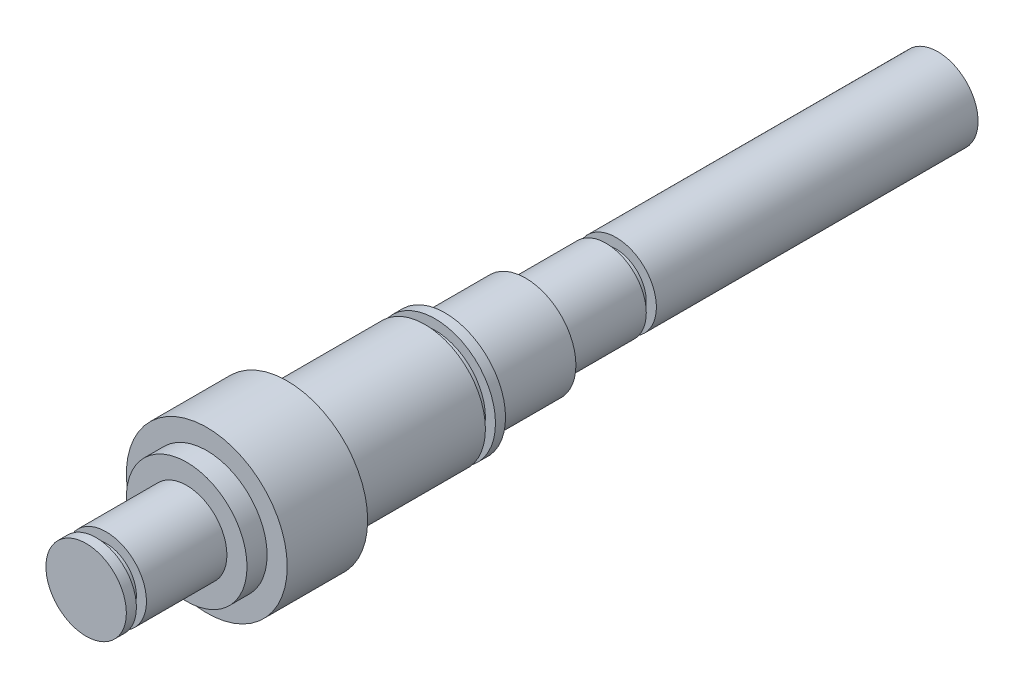
ISO-10303-21;
HEADER;
FILE_DESCRIPTION(('STEP AP214'),'2;1');
FILE_NAME('part.step','',(''),(''),'','','');
FILE_SCHEMA(('AUTOMOTIVE_DESIGN { 1 0 10303 214 1 1 1 1 }'));
ENDSEC;
DATA;
#1=APPLICATION_CONTEXT('core data for automotive mechanical design processes');
#2=APPLICATION_PROTOCOL_DEFINITION('international standard','automotive_design',2000,#1);
#3=PRODUCT_CONTEXT('',#1,'mechanical');
#4=PRODUCT('Part','Part','',(#3));
#5=PRODUCT_RELATED_PRODUCT_CATEGORY('part','',(#4));
#6=PRODUCT_DEFINITION_FORMATION('','',#4);
#7=PRODUCT_DEFINITION_CONTEXT('part definition',#1,'design');
#8=PRODUCT_DEFINITION('design','',#6,#7);
#9=PRODUCT_DEFINITION_SHAPE('','',#8);
#10=(LENGTH_UNIT() NAMED_UNIT(*) SI_UNIT(.MILLI.,.METRE.));
#11=(NAMED_UNIT(*) PLANE_ANGLE_UNIT() SI_UNIT($,.RADIAN.));
#12=(NAMED_UNIT(*) SI_UNIT($,.STERADIAN.) SOLID_ANGLE_UNIT());
#13=UNCERTAINTY_MEASURE_WITH_UNIT(LENGTH_MEASURE(1.E-05),#10,'distance_accuracy_value','');
#14=(GEOMETRIC_REPRESENTATION_CONTEXT(3) GLOBAL_UNCERTAINTY_ASSIGNED_CONTEXT((#13)) GLOBAL_UNIT_ASSIGNED_CONTEXT((#10,
#11,#12)) REPRESENTATION_CONTEXT('',''));
#15=CARTESIAN_POINT('',(0.,0.,0.));
#16=DIRECTION('',(0.,0.,1.));
#17=DIRECTION('',(1.,0.,0.));
#18=AXIS2_PLACEMENT_3D('',#15,#16,#17);
#19=CARTESIAN_POINT('',(0.,0.,25.4));
#20=DIRECTION('',(0.,0.,-1.));
#21=DIRECTION('',(-1.,0.,0.));
#22=AXIS2_PLACEMENT_3D('',#19,#20,#21);
#23=CYLINDRICAL_SURFACE('',#22,12.7);
#24=CARTESIAN_POINT('',(0.,0.,25.4));
#25=DIRECTION('',(0.,0.,1.));
#26=DIRECTION('',(1.,0.,0.));
#27=AXIS2_PLACEMENT_3D('',#24,#25,#26);
#28=CIRCLE('',#27,12.7);
#29=CARTESIAN_POINT('',(12.7,0.,25.4));
#30=VERTEX_POINT('',#29);
#31=EDGE_CURVE('E154',#30,#30,#28,.T.);
#32=ORIENTED_EDGE('',*,*,#31,.F.);
#33=EDGE_LOOP('',(#32));
#34=FACE_BOUND('',#33,.T.);
#35=CARTESIAN_POINT('',(0.,0.,0.));
#36=DIRECTION('',(0.,0.,1.));
#37=DIRECTION('',(1.,0.,0.));
#38=AXIS2_PLACEMENT_3D('',#35,#36,#37);
#39=CIRCLE('',#38,12.7);
#40=CARTESIAN_POINT('',(12.7,0.,0.));
#41=VERTEX_POINT('',#40);
#42=EDGE_CURVE('E164',#41,#41,#39,.T.);
#43=ORIENTED_EDGE('',*,*,#42,.T.);
#44=EDGE_LOOP('',(#43));
#45=FACE_BOUND('',#44,.T.);
#46=ADVANCED_FACE('F46',(#34,#45),#23,.T.);
#47=CARTESIAN_POINT('',(0.,0.,0.));
#48=DIRECTION('',(0.,0.,1.));
#49=DIRECTION('',(1.,0.,0.));
#50=AXIS2_PLACEMENT_3D('',#47,#48,#49);
#51=PLANE('',#50);
#52=CARTESIAN_POINT('',(0.,0.,0.));
#53=DIRECTION('',(0.,0.,-1.));
#54=DIRECTION('',(-1.,0.,0.));
#55=AXIS2_PLACEMENT_3D('',#52,#53,#54);
#56=CIRCLE('',#55,9.525);
#57=CARTESIAN_POINT('',(-9.525,0.,0.));
#58=VERTEX_POINT('',#57);
#59=EDGE_CURVE('E54',#58,#58,#56,.T.);
#60=ORIENTED_EDGE('',*,*,#59,.F.);
#61=EDGE_LOOP('',(#60));
#62=FACE_BOUND('',#61,.T.);
#63=ORIENTED_EDGE('',*,*,#42,.F.);
#64=EDGE_LOOP('',(#63));
#65=FACE_BOUND('',#64,.T.);
#66=ADVANCED_FACE('F237',(#62,#65),#51,.F.);
#67=CARTESIAN_POINT('',(0.,0.,50.8));
#68=DIRECTION('',(0.,0.,-1.));
#69=DIRECTION('',(-1.,0.,0.));
#70=AXIS2_PLACEMENT_3D('',#67,#68,#69);
#71=CYLINDRICAL_SURFACE('',#70,15.875);
#72=CARTESIAN_POINT('',(0.,0.,50.8));
#73=DIRECTION('',(0.,0.,1.));
#74=DIRECTION('',(1.,0.,0.));
#75=AXIS2_PLACEMENT_3D('',#72,#73,#74);
#76=CIRCLE('',#75,15.875);
#77=CARTESIAN_POINT('',(15.875,0.,50.8));
#78=VERTEX_POINT('',#77);
#79=EDGE_CURVE('E161',#78,#78,#76,.T.);
#80=ORIENTED_EDGE('',*,*,#79,.F.);
#81=EDGE_LOOP('',(#80));
#82=FACE_BOUND('',#81,.T.);
#83=CARTESIAN_POINT('',(0.,0.,25.4));
#84=DIRECTION('',(0.,0.,1.));
#85=DIRECTION('',(1.,0.,0.));
#86=AXIS2_PLACEMENT_3D('',#83,#84,#85);
#87=CIRCLE('',#86,15.875);
#88=CARTESIAN_POINT('',(15.875,0.,25.4));
#89=VERTEX_POINT('',#88);
#90=EDGE_CURVE('E158',#89,#89,#87,.T.);
#91=ORIENTED_EDGE('',*,*,#90,.T.);
#92=EDGE_LOOP('',(#91));
#93=FACE_BOUND('',#92,.T.);
#94=ADVANCED_FACE('F242',(#82,#93),#71,.T.);
#95=CARTESIAN_POINT('',(0.,0.,25.4));
#96=DIRECTION('',(0.,0.,1.));
#97=DIRECTION('',(1.,0.,0.));
#98=AXIS2_PLACEMENT_3D('',#95,#96,#97);
#99=PLANE('',#98);
#100=ORIENTED_EDGE('',*,*,#31,.T.);
#101=EDGE_LOOP('',(#100));
#102=FACE_BOUND('',#101,.T.);
#103=ORIENTED_EDGE('',*,*,#90,.F.);
#104=EDGE_LOOP('',(#103));
#105=FACE_BOUND('',#104,.T.);
#106=ADVANCED_FACE('F249',(#102,#105),#99,.F.);
#107=CARTESIAN_POINT('',(0.,0.,53.975));
#108=DIRECTION('',(0.,0.,-1.));
#109=DIRECTION('',(-1.,0.,0.));
#110=AXIS2_PLACEMENT_3D('',#107,#108,#109);
#111=CYLINDRICAL_SURFACE('',#110,19.05);
#112=CARTESIAN_POINT('',(0.,0.,53.975));
#113=DIRECTION('',(0.,0.,1.));
#114=DIRECTION('',(1.,0.,0.));
#115=AXIS2_PLACEMENT_3D('',#112,#113,#114);
#116=CIRCLE('',#115,19.05);
#117=CARTESIAN_POINT('',(19.05,0.,53.975));
#118=VERTEX_POINT('',#117);
#119=EDGE_CURVE('E155',#118,#118,#116,.T.);
#120=ORIENTED_EDGE('',*,*,#119,.F.);
#121=EDGE_LOOP('',(#120));
#122=FACE_BOUND('',#121,.T.);
#123=CARTESIAN_POINT('',(0.,0.,50.8));
#124=DIRECTION('',(0.,0.,1.));
#125=DIRECTION('',(1.,0.,0.));
#126=AXIS2_PLACEMENT_3D('',#123,#124,#125);
#127=CIRCLE('',#126,19.05);
#128=CARTESIAN_POINT('',(19.05,0.,50.8));
#129=VERTEX_POINT('',#128);
#130=EDGE_CURVE('E151',#129,#129,#127,.T.);
#131=ORIENTED_EDGE('',*,*,#130,.T.);
#132=EDGE_LOOP('',(#131));
#133=FACE_BOUND('',#132,.T.);
#134=ADVANCED_FACE('F252',(#122,#133),#111,.T.);
#135=CARTESIAN_POINT('',(0.,0.,53.975));
#136=DIRECTION('',(0.,0.,1.));
#137=DIRECTION('',(1.,0.,0.));
#138=AXIS2_PLACEMENT_3D('',#135,#136,#137);
#139=PLANE('',#138);
#140=CARTESIAN_POINT('',(0.,0.,53.975));
#141=DIRECTION('',(0.,0.,1.));
#142=DIRECTION('',(1.,0.,0.));
#143=AXIS2_PLACEMENT_3D('',#140,#141,#142);
#144=CIRCLE('',#143,15.875);
#145=CARTESIAN_POINT('',(15.875,0.,53.975));
#146=VERTEX_POINT('',#145);
#147=EDGE_CURVE('E136',#146,#146,#144,.T.);
#148=ORIENTED_EDGE('',*,*,#147,.F.);
#149=EDGE_LOOP('',(#148));
#150=FACE_BOUND('',#149,.T.);
#151=ORIENTED_EDGE('',*,*,#119,.T.);
#152=EDGE_LOOP('',(#151));
#153=FACE_BOUND('',#152,.T.);
#154=ADVANCED_FACE('F265',(#150,#153),#139,.T.);
#155=CARTESIAN_POINT('',(0.,0.,50.8));
#156=DIRECTION('',(0.,0.,1.));
#157=DIRECTION('',(1.,0.,0.));
#158=AXIS2_PLACEMENT_3D('',#155,#156,#157);
#159=PLANE('',#158);
#160=ORIENTED_EDGE('',*,*,#79,.T.);
#161=EDGE_LOOP('',(#160));
#162=FACE_BOUND('',#161,.T.);
#163=ORIENTED_EDGE('',*,*,#130,.F.);
#164=EDGE_LOOP('',(#163));
#165=FACE_BOUND('',#164,.T.);
#166=ADVANCED_FACE('F267',(#162,#165),#159,.F.);
#167=CARTESIAN_POINT('',(0.,0.,57.15));
#168=DIRECTION('',(0.,0.,-1.));
#169=DIRECTION('',(-1.,0.,0.));
#170=AXIS2_PLACEMENT_3D('',#167,#168,#169);
#171=CYLINDRICAL_SURFACE('',#170,15.875);
#172=CARTESIAN_POINT('',(0.,0.,57.15));
#173=DIRECTION('',(0.,0.,1.));
#174=DIRECTION('',(1.,0.,0.));
#175=AXIS2_PLACEMENT_3D('',#172,#173,#174);
#176=CIRCLE('',#175,15.875);
#177=CARTESIAN_POINT('',(15.875,0.,57.15));
#178=VERTEX_POINT('',#177);
#179=EDGE_CURVE('E146',#178,#178,#176,.T.);
#180=ORIENTED_EDGE('',*,*,#179,.F.);
#181=EDGE_LOOP('',(#180));
#182=FACE_BOUND('',#181,.T.);
#183=ORIENTED_EDGE('',*,*,#147,.T.);
#184=EDGE_LOOP('',(#183));
#185=FACE_BOUND('',#184,.T.);
#186=ADVANCED_FACE('F233',(#182,#185),#171,.T.);
#187=CARTESIAN_POINT('',(0.,0.,100.6856));
#188=DIRECTION('',(0.,0.,-1.));
#189=DIRECTION('',(-1.,0.,0.));
#190=AXIS2_PLACEMENT_3D('',#187,#188,#189);
#191=CYLINDRICAL_SURFACE('',#190,19.05);
#192=DIRECTION('',(0.,0.,-1.));
#193=VECTOR('',#192,1.);
#194=CARTESIAN_POINT('',(-3.175,-18.7835533113413,100.6856));
#195=LINE('',#194,#193);
#196=CARTESIAN_POINT('',(-3.175,-18.7835533113413,69.3928));
#197=VERTEX_POINT('',#196);
#198=CARTESIAN_POINT('',(-3.175,-18.7835533113413,88.4428));
#199=VERTEX_POINT('',#198);
#200=EDGE_CURVE('E49',#197,#199,#195,.F.);
#201=ORIENTED_EDGE('',*,*,#200,.T.);
#202=CARTESIAN_POINT('',(-3.17500000000001,-18.7835533113413,88.4428));
#203=CARTESIAN_POINT('',(-3.1750092759533,-18.783547018576,88.5314388053393));
#204=CARTESIAN_POINT('',(-3.17128819348967,-18.7841805998717,88.6200726993502));
#205=CARTESIAN_POINT('',(-3.15645721193542,-18.786680956619,88.7966940232313));
#206=CARTESIAN_POINT('',(-3.14534805241957,-18.7885476086355,88.8846815169173));
#207=CARTESIAN_POINT('',(-3.11583156311776,-18.79346444303,89.0592803464566));
#208=CARTESIAN_POINT('',(-3.0974335288372,-18.7965131178684,89.1458932895173));
#209=CARTESIAN_POINT('',(-3.05349803864484,-18.8037001907753,89.31721767784));
#210=CARTESIAN_POINT('',(-3.0279605898953,-18.8078385877505,89.4019291250095));
#211=CARTESIAN_POINT('',(-2.94087840596814,-18.8217226326604,89.6523560592743));
#212=CARTESIAN_POINT('',(-2.8688436825383,-18.8329407053693,89.8144825025615));
#213=CARTESIAN_POINT('',(-2.69899239592742,-18.8580290540045,90.1242636460318));
#214=CARTESIAN_POINT('',(-2.60117549729128,-18.8718993644387,90.2719181578843));
#215=CARTESIAN_POINT('',(-2.38149517786338,-18.9008817527466,90.5501135942982));
#216=CARTESIAN_POINT('',(-2.25942968994262,-18.9160035960679,90.6804942202037));
#217=CARTESIAN_POINT('',(-1.99514735350751,-18.9456996695127,90.9190292183636));
#218=CARTESIAN_POINT('',(-1.85292742138645,-18.9602738154065,91.0271801832893));
#219=CARTESIAN_POINT('',(-1.55132985812669,-18.9873352365175,91.2187867277449));
#220=CARTESIAN_POINT('',(-1.3918551557364,-18.9998095762792,91.3020915108715));
#221=CARTESIAN_POINT('',(-1.06094262734604,-19.0211554700442,91.4406650549574));
#222=CARTESIAN_POINT('',(-0.889506261733393,-19.0300274629556,91.4959372315998));
#223=CARTESIAN_POINT('',(-0.541204609731064,-19.0431004523526,91.5763880044264));
#224=CARTESIAN_POINT('',(-0.364403899939723,-19.0473437341617,91.6018391902149));
#225=CARTESIAN_POINT('',(-0.00898986065481108,-19.0508265250604,91.6227731224316));
#226=CARTESIAN_POINT('',(0.169623388276826,-19.0500662555787,91.6182571950335));
#227=CARTESIAN_POINT('',(0.521719337398837,-19.0436608919272,91.5795966229835));
#228=CARTESIAN_POINT('',(0.695235345117891,-19.0380642966246,91.5457461369747));
#229=CARTESIAN_POINT('',(1.03408837128149,-19.0226692681399,91.4498407274997));
#230=CARTESIAN_POINT('',(1.19942519266638,-19.0128707337761,91.3877851248594));
#231=CARTESIAN_POINT('',(1.51810527783592,-18.9900900579044,91.23693752744));
#232=CARTESIAN_POINT('',(1.67138986912094,-18.9770934783148,91.1480238513692));
#233=CARTESIAN_POINT('',(1.96096832556615,-18.9493613252356,90.9460763114251));
#234=CARTESIAN_POINT('',(2.09726144683351,-18.9346256756637,90.8330413921021));
#235=CARTESIAN_POINT('',(2.35071590026175,-18.9048444663073,90.5844458544069));
#236=CARTESIAN_POINT('',(2.46762776771632,-18.8897973100375,90.4486309773923));
#237=CARTESIAN_POINT('',(2.67707682879147,-18.8612558492788,90.1591343348761));
#238=CARTESIAN_POINT('',(2.76960707287949,-18.8477619881439,90.0054474932527));
#239=CARTESIAN_POINT('',(2.92771595769529,-18.8238521316789,89.6842585044252));
#240=CARTESIAN_POINT('',(2.99324880029341,-18.8134413748372,89.5167334553005));
#241=CARTESIAN_POINT('',(3.09508123713193,-18.7969592772761,89.1729556798652));
#242=CARTESIAN_POINT('',(3.1314245377521,-18.7908814502698,88.9967164232592));
#243=CARTESIAN_POINT('',(3.16010272278867,-18.786066088157,88.7564140581634));
#244=CARTESIAN_POINT('',(3.16569153246618,-18.7851246388065,88.6937698049232));
#245=CARTESIAN_POINT('',(3.17313530936847,-18.7838688841059,88.5683595013504));
#246=CARTESIAN_POINT('',(3.17499655594535,-18.7835535240705,88.5055938344384));
#247=CARTESIAN_POINT('',(3.175,-18.7835533113413,88.4428));
#248=B_SPLINE_CURVE_WITH_KNOTS('',3,(#202,#203,#204,#205,#206,#207,#208,#209,#210,#211,#212,
#213,#214,#215,#216,#217,#218,#219,#220,#221,#222,#223,#224,#225,#226,#227,#228,#229,#230,#231,
#232,#233,#234,#235,#236,#237,#238,#239,#240,#241,#242,#243,#244,#245,#246,#247),.UNSPECIFIED.,
.F.,.F.,(4,2,2,2,2,2,2,2,2,2,2,2,2,2,2,2,2,2,2,2,2,2,4),(0.,0.265827424316422,0.531628242295368,
0.797091169938624,1.06255383127045,1.59312333078712,2.12369973395087,2.65889847189159,
3.19417918320543,3.73264543374023,4.27104605811873,4.80448586210931,5.33790205925133,
5.86603040471272,6.3941714680841,6.92474212132518,7.45533599499394,7.99230308222494,
8.52942305687614,9.06745048147124,9.60467079162542,9.79328570472903,9.98158261408197),.UNSPECIFIED.);
#249=CARTESIAN_POINT('',(3.175,-18.7835533113413,88.4428));
#250=VERTEX_POINT('',#249);
#251=EDGE_CURVE('E129',#199,#250,#248,.T.);
#252=ORIENTED_EDGE('',*,*,#251,.T.);
#253=DIRECTION('',(0.,0.,-1.));
#254=VECTOR('',#253,1.);
#255=CARTESIAN_POINT('',(3.17500000000001,-18.7835533113413,100.6856));
#256=LINE('',#255,#254);
#257=CARTESIAN_POINT('',(3.17500000000001,-18.7835533113413,69.3928));
#258=VERTEX_POINT('',#257);
#259=EDGE_CURVE('E504',#250,#258,#256,.T.);
#260=ORIENTED_EDGE('',*,*,#259,.T.);
#261=CARTESIAN_POINT('',(3.175,-18.7835533113413,69.3928));
#262=CARTESIAN_POINT('',(3.1750092759533,-18.783547018576,69.3041611946607));
#263=CARTESIAN_POINT('',(3.17128819348967,-18.7841805998717,69.2155273006497));
#264=CARTESIAN_POINT('',(3.15645721193542,-18.786680956619,69.0389059767687));
#265=CARTESIAN_POINT('',(3.14534805241957,-18.7885476086355,68.9509184830827));
#266=CARTESIAN_POINT('',(3.11583156311776,-18.79346444303,68.7763196535433));
#267=CARTESIAN_POINT('',(3.0974335288372,-18.7965131178684,68.6897067104826));
#268=CARTESIAN_POINT('',(3.05349803864483,-18.8037001907753,68.5183823221599));
#269=CARTESIAN_POINT('',(3.02796058989529,-18.8078385877505,68.4336708749905));
#270=CARTESIAN_POINT('',(2.94087840596814,-18.8217226326604,68.1832439407257));
#271=CARTESIAN_POINT('',(2.8688436825383,-18.8329407053693,68.0211174974384));
#272=CARTESIAN_POINT('',(2.69899239592742,-18.8580290540045,67.7113363539682));
#273=CARTESIAN_POINT('',(2.60117549729128,-18.8718993644387,67.5636818421157));
#274=CARTESIAN_POINT('',(2.38149517786337,-18.9008817527466,67.2854864057018));
#275=CARTESIAN_POINT('',(2.25942968994262,-18.9160035960679,67.1551057797962));
#276=CARTESIAN_POINT('',(1.99514735350751,-18.9456996695127,66.9165707816364));
#277=CARTESIAN_POINT('',(1.85292742138645,-18.9602738154065,66.8084198167107));
#278=CARTESIAN_POINT('',(1.55132985812669,-18.9873352365175,66.616813272255));
#279=CARTESIAN_POINT('',(1.3918551557364,-18.9998095762792,66.5335084891284));
#280=CARTESIAN_POINT('',(1.06094262734604,-19.0211554700442,66.3949349450426));
#281=CARTESIAN_POINT('',(0.889506261733391,-19.0300274629556,66.3396627684001));
#282=CARTESIAN_POINT('',(0.541204609731062,-19.0431004523526,66.2592119955735));
#283=CARTESIAN_POINT('',(0.364403899939721,-19.0473437341617,66.233760809785));
#284=CARTESIAN_POINT('',(0.00898986065480973,-19.0508265250604,66.2128268775683));
#285=CARTESIAN_POINT('',(-0.169623388276827,-19.0500662555787,66.2173428049665));
#286=CARTESIAN_POINT('',(-0.521719337398839,-19.0436608919272,66.2560033770164));
#287=CARTESIAN_POINT('',(-0.695235345117893,-19.0380642966246,66.2898538630253));
#288=CARTESIAN_POINT('',(-1.0340883712815,-19.0226692681399,66.3857592725003));
#289=CARTESIAN_POINT('',(-1.19942519266639,-19.0128707337761,66.4478148751405));
#290=CARTESIAN_POINT('',(-1.51810527783592,-18.9900900579044,66.59866247256));
#291=CARTESIAN_POINT('',(-1.67138986912094,-18.9770934783148,66.6875761486308));
#292=CARTESIAN_POINT('',(-1.96096832556615,-18.9493613252356,66.8895236885748));
#293=CARTESIAN_POINT('',(-2.09726144683351,-18.9346256756637,67.0025586078979));
#294=CARTESIAN_POINT('',(-2.35071590026175,-18.9048444663073,67.2511541455931));
#295=CARTESIAN_POINT('',(-2.46762776771632,-18.8897973100375,67.3869690226077));
#296=CARTESIAN_POINT('',(-2.67707682879147,-18.8612558492788,67.6764656651238));
#297=CARTESIAN_POINT('',(-2.76960707287949,-18.8477619881439,67.8301525067473));
#298=CARTESIAN_POINT('',(-2.92771595769529,-18.8238521316789,68.1513414955748));
#299=CARTESIAN_POINT('',(-2.99324880029341,-18.8134413748372,68.3188665446994));
#300=CARTESIAN_POINT('',(-3.09508123713194,-18.7969592772761,68.6626443201348));
#301=CARTESIAN_POINT('',(-3.1314245377521,-18.7908814502698,68.8388835767408));
#302=CARTESIAN_POINT('',(-3.16010272278867,-18.786066088157,69.0791859418366));
#303=CARTESIAN_POINT('',(-3.16569153246618,-18.7851246388065,69.1418301950768));
#304=CARTESIAN_POINT('',(-3.17313530936847,-18.7838688841059,69.2672404986495));
#305=CARTESIAN_POINT('',(-3.17499655594535,-18.7835535240705,69.3300061655616));
#306=CARTESIAN_POINT('',(-3.17500000000001,-18.7835533113413,69.3928));
#307=B_SPLINE_CURVE_WITH_KNOTS('',3,(#261,#262,#263,#264,#265,#266,#267,#268,#269,#270,#271,
#272,#273,#274,#275,#276,#277,#278,#279,#280,#281,#282,#283,#284,#285,#286,#287,#288,#289,#290,
#291,#292,#293,#294,#295,#296,#297,#298,#299,#300,#301,#302,#303,#304,#305,#306),.UNSPECIFIED.,
.F.,.F.,(4,2,2,2,2,2,2,2,2,2,2,2,2,2,2,2,2,2,2,2,2,2,4),(0.,0.265827424316422,0.531628242295368,
0.797091169938638,1.06255383127045,1.59312333078712,2.12369973395087,2.65889847189159,
3.19417918320543,3.73264543374023,4.27104605811873,4.80448586210931,5.33790205925133,
5.86603040471272,6.3941714680841,6.92474212132518,7.45533599499394,7.99230308222494,
8.52942305687614,9.06745048147124,9.60467079162542,9.79328570472902,9.98158261408196),.UNSPECIFIED.);
#308=EDGE_CURVE('E62',#258,#197,#307,.T.);
#309=ORIENTED_EDGE('',*,*,#308,.T.);
#310=EDGE_LOOP('',(#201,#252,#260,#309));
#311=FACE_BOUND('',#310,.T.);
#312=CARTESIAN_POINT('',(0.,0.,100.6856));
#313=DIRECTION('',(0.,0.,1.));
#314=DIRECTION('',(1.,0.,0.));
#315=AXIS2_PLACEMENT_3D('',#312,#313,#314);
#316=CIRCLE('',#315,19.05);
#317=CARTESIAN_POINT('',(19.05,0.,100.6856));
#318=VERTEX_POINT('',#317);
#319=EDGE_CURVE('E143',#318,#318,#316,.T.);
#320=ORIENTED_EDGE('',*,*,#319,.F.);
#321=EDGE_LOOP('',(#320));
#322=FACE_BOUND('',#321,.T.);
#323=CARTESIAN_POINT('',(0.,0.,57.15));
#324=DIRECTION('',(0.,0.,1.));
#325=DIRECTION('',(1.,0.,0.));
#326=AXIS2_PLACEMENT_3D('',#323,#324,#325);
#327=CIRCLE('',#326,19.05);
#328=CARTESIAN_POINT('',(19.05,0.,57.15));
#329=VERTEX_POINT('',#328);
#330=EDGE_CURVE('E140',#329,#329,#327,.T.);
#331=ORIENTED_EDGE('',*,*,#330,.T.);
#332=EDGE_LOOP('',(#331));
#333=FACE_BOUND('',#332,.T.);
#334=ADVANCED_FACE('F184',(#311,#322,#333),#191,.T.);
#335=CARTESIAN_POINT('',(0.,0.,57.15));
#336=DIRECTION('',(0.,0.,1.));
#337=DIRECTION('',(1.,0.,0.));
#338=AXIS2_PLACEMENT_3D('',#335,#336,#337);
#339=PLANE('',#338);
#340=ORIENTED_EDGE('',*,*,#179,.T.);
#341=EDGE_LOOP('',(#340));
#342=FACE_BOUND('',#341,.T.);
#343=ORIENTED_EDGE('',*,*,#330,.F.);
#344=EDGE_LOOP('',(#343));
#345=FACE_BOUND('',#344,.T.);
#346=ADVANCED_FACE('F226',(#342,#345),#339,.F.);
#347=CARTESIAN_POINT('',(0.,0.,126.0856));
#348=DIRECTION('',(0.,0.,-1.));
#349=DIRECTION('',(-1.,0.,0.));
#350=AXIS2_PLACEMENT_3D('',#347,#348,#349);
#351=CYLINDRICAL_SURFACE('',#350,25.4);
#352=CARTESIAN_POINT('',(0.,0.,126.0856));
#353=DIRECTION('',(0.,0.,1.));
#354=DIRECTION('',(1.,0.,0.));
#355=AXIS2_PLACEMENT_3D('',#352,#353,#354);
#356=CIRCLE('',#355,25.4);
#357=CARTESIAN_POINT('',(25.4,0.,126.0856));
#358=VERTEX_POINT('',#357);
#359=EDGE_CURVE('E137',#358,#358,#356,.T.);
#360=ORIENTED_EDGE('',*,*,#359,.F.);
#361=EDGE_LOOP('',(#360));
#362=FACE_BOUND('',#361,.T.);
#363=CARTESIAN_POINT('',(0.,0.,100.6856));
#364=DIRECTION('',(0.,0.,1.));
#365=DIRECTION('',(1.,0.,0.));
#366=AXIS2_PLACEMENT_3D('',#363,#364,#365);
#367=CIRCLE('',#366,25.4);
#368=CARTESIAN_POINT('',(25.4,0.,100.6856));
#369=VERTEX_POINT('',#368);
#370=EDGE_CURVE('E133',#369,#369,#367,.T.);
#371=ORIENTED_EDGE('',*,*,#370,.T.);
#372=EDGE_LOOP('',(#371));
#373=FACE_BOUND('',#372,.T.);
#374=ADVANCED_FACE('F220',(#362,#373),#351,.T.);
#375=CARTESIAN_POINT('',(0.,0.,126.0856));
#376=DIRECTION('',(0.,0.,1.));
#377=DIRECTION('',(1.,0.,0.));
#378=AXIS2_PLACEMENT_3D('',#375,#376,#377);
#379=PLANE('',#378);
#380=CARTESIAN_POINT('',(0.,0.,126.0856));
#381=DIRECTION('',(0.,0.,1.));
#382=DIRECTION('',(1.,0.,0.));
#383=AXIS2_PLACEMENT_3D('',#380,#381,#382);
#384=CIRCLE('',#383,19.05);
#385=CARTESIAN_POINT('',(19.05,0.,126.0856));
#386=VERTEX_POINT('',#385);
#387=EDGE_CURVE('E130',#386,#386,#384,.T.);
#388=ORIENTED_EDGE('',*,*,#387,.F.);
#389=EDGE_LOOP('',(#388));
#390=FACE_BOUND('',#389,.T.);
#391=ORIENTED_EDGE('',*,*,#359,.T.);
#392=EDGE_LOOP('',(#391));
#393=FACE_BOUND('',#392,.T.);
#394=ADVANCED_FACE('F217',(#390,#393),#379,.T.);
#395=CARTESIAN_POINT('',(0.,0.,100.6856));
#396=DIRECTION('',(0.,0.,1.));
#397=DIRECTION('',(1.,0.,0.));
#398=AXIS2_PLACEMENT_3D('',#395,#396,#397);
#399=PLANE('',#398);
#400=ORIENTED_EDGE('',*,*,#319,.T.);
#401=EDGE_LOOP('',(#400));
#402=FACE_BOUND('',#401,.T.);
#403=ORIENTED_EDGE('',*,*,#370,.F.);
#404=EDGE_LOOP('',(#403));
#405=FACE_BOUND('',#404,.T.);
#406=ADVANCED_FACE('F215',(#402,#405),#399,.F.);
#407=CARTESIAN_POINT('',(0.,0.,132.4356));
#408=DIRECTION('',(0.,0.,-1.));
#409=DIRECTION('',(-1.,0.,0.));
#410=AXIS2_PLACEMENT_3D('',#407,#408,#409);
#411=CYLINDRICAL_SURFACE('',#410,19.05);
#412=CARTESIAN_POINT('',(0.,0.,132.4356));
#413=DIRECTION('',(0.,0.,1.));
#414=DIRECTION('',(1.,0.,0.));
#415=AXIS2_PLACEMENT_3D('',#412,#413,#414);
#416=CIRCLE('',#415,19.05);
#417=CARTESIAN_POINT('',(19.05,0.,132.4356));
#418=VERTEX_POINT('',#417);
#419=EDGE_CURVE('E125',#418,#418,#416,.T.);
#420=ORIENTED_EDGE('',*,*,#419,.F.);
#421=EDGE_LOOP('',(#420));
#422=FACE_BOUND('',#421,.T.);
#423=ORIENTED_EDGE('',*,*,#387,.T.);
#424=EDGE_LOOP('',(#423));
#425=FACE_BOUND('',#424,.T.);
#426=ADVANCED_FACE('F211',(#422,#425),#411,.T.);
#427=CARTESIAN_POINT('',(0.,0.,132.4356));
#428=DIRECTION('',(0.,0.,1.));
#429=DIRECTION('',(1.,0.,0.));
#430=AXIS2_PLACEMENT_3D('',#427,#428,#429);
#431=PLANE('',#430);
#432=CARTESIAN_POINT('',(0.,0.,132.4356));
#433=DIRECTION('',(0.,0.,1.));
#434=DIRECTION('',(1.,0.,0.));
#435=AXIS2_PLACEMENT_3D('',#432,#433,#434);
#436=CIRCLE('',#435,12.7);
#437=CARTESIAN_POINT('',(12.7,0.,132.4356));
#438=VERTEX_POINT('',#437);
#439=EDGE_CURVE('E126',#438,#438,#436,.T.);
#440=ORIENTED_EDGE('',*,*,#439,.F.);
#441=EDGE_LOOP('',(#440));
#442=FACE_BOUND('',#441,.T.);
#443=ORIENTED_EDGE('',*,*,#419,.T.);
#444=EDGE_LOOP('',(#443));
#445=FACE_BOUND('',#444,.T.);
#446=ADVANCED_FACE('F207',(#442,#445),#431,.T.);
#447=CARTESIAN_POINT('',(0.,0.,157.8356));
#448=DIRECTION('',(0.,0.,-1.));
#449=DIRECTION('',(-1.,0.,0.));
#450=AXIS2_PLACEMENT_3D('',#447,#448,#449);
#451=CYLINDRICAL_SURFACE('',#450,12.7);
#452=CARTESIAN_POINT('',(0.,0.,157.8356));
#453=DIRECTION('',(0.,0.,1.));
#454=DIRECTION('',(1.,0.,0.));
#455=AXIS2_PLACEMENT_3D('',#452,#453,#454);
#456=CIRCLE('',#455,12.7);
#457=CARTESIAN_POINT('',(12.7,0.,157.8356));
#458=VERTEX_POINT('',#457);
#459=EDGE_CURVE('E119',#458,#458,#456,.T.);
#460=ORIENTED_EDGE('',*,*,#459,.F.);
#461=EDGE_LOOP('',(#460));
#462=FACE_BOUND('',#461,.T.);
#463=ORIENTED_EDGE('',*,*,#439,.T.);
#464=EDGE_LOOP('',(#463));
#465=FACE_BOUND('',#464,.T.);
#466=ADVANCED_FACE('F203',(#462,#465),#451,.T.);
#467=CARTESIAN_POINT('',(0.,0.,157.8356));
#468=DIRECTION('',(0.,0.,1.));
#469=DIRECTION('',(1.,0.,0.));
#470=AXIS2_PLACEMENT_3D('',#467,#468,#469);
#471=PLANE('',#470);
#472=CARTESIAN_POINT('',(0.,0.,157.8356));
#473=DIRECTION('',(0.,0.,1.));
#474=DIRECTION('',(1.,0.,0.));
#475=AXIS2_PLACEMENT_3D('',#472,#473,#474);
#476=CIRCLE('',#475,9.525);
#477=CARTESIAN_POINT('',(9.525,0.,157.8356));
#478=VERTEX_POINT('',#477);
#479=EDGE_CURVE('E13',#478,#478,#476,.T.);
#480=ORIENTED_EDGE('',*,*,#479,.F.);
#481=EDGE_LOOP('',(#480));
#482=FACE_BOUND('',#481,.T.);
#483=ORIENTED_EDGE('',*,*,#459,.T.);
#484=EDGE_LOOP('',(#483));
#485=FACE_BOUND('',#484,.T.);
#486=ADVANCED_FACE('F200',(#482,#485),#471,.T.);
#487=CARTESIAN_POINT('',(0.,-15.875,69.3928));
#488=DIRECTION('',(0.,-1.,0.));
#489=DIRECTION('',(0.,0.,-1.));
#490=AXIS2_PLACEMENT_3D('',#487,#488,#489);
#491=CYLINDRICAL_SURFACE('',#490,3.175);
#492=DIRECTION('',(0.,-1.,0.));
#493=VECTOR('',#492,1.);
#494=CARTESIAN_POINT('',(3.17500000000001,-15.875,69.3928));
#495=LINE('',#494,#493);
#496=CARTESIAN_POINT('',(3.17500000000001,-15.875,69.3928));
#497=VERTEX_POINT('',#496);
#498=EDGE_CURVE('E86',#497,#258,#495,.T.);
#499=ORIENTED_EDGE('',*,*,#498,.F.);
#500=CARTESIAN_POINT('',(0.,-15.875,69.3928));
#501=DIRECTION('',(0.,-1.,0.));
#502=DIRECTION('',(0.,0.,-1.));
#503=AXIS2_PLACEMENT_3D('',#500,#501,#502);
#504=CIRCLE('',#503,3.175);
#505=CARTESIAN_POINT('',(-3.175,-15.875,69.3928));
#506=VERTEX_POINT('',#505);
#507=EDGE_CURVE('E90',#506,#497,#504,.T.);
#508=ORIENTED_EDGE('',*,*,#507,.F.);
#509=DIRECTION('',(0.,-1.,0.));
#510=VECTOR('',#509,1.);
#511=CARTESIAN_POINT('',(-3.175,-15.875,69.3928));
#512=LINE('',#511,#510);
#513=EDGE_CURVE('E117',#506,#197,#512,.T.);
#514=ORIENTED_EDGE('',*,*,#513,.T.);
#515=ORIENTED_EDGE('',*,*,#308,.F.);
#516=EDGE_LOOP('',(#499,#508,#514,#515));
#517=FACE_BOUND('',#516,.T.);
#518=ADVANCED_FACE('F88',(#517),#491,.F.);
#519=CARTESIAN_POINT('',(-3.175,-15.875,69.3928));
#520=DIRECTION('',(-1.,0.,0.));
#521=DIRECTION('',(0.,0.,1.));
#522=AXIS2_PLACEMENT_3D('',#519,#520,#521);
#523=PLANE('',#522);
#524=ORIENTED_EDGE('',*,*,#513,.F.);
#525=DIRECTION('',(0.,0.,-1.));
#526=VECTOR('',#525,1.);
#527=CARTESIAN_POINT('',(-3.175,-15.875,69.3928));
#528=LINE('',#527,#526);
#529=CARTESIAN_POINT('',(-3.175,-15.875,88.4428));
#530=VERTEX_POINT('',#529);
#531=EDGE_CURVE('E95',#530,#506,#528,.T.);
#532=ORIENTED_EDGE('',*,*,#531,.F.);
#533=DIRECTION('',(0.,-1.,0.));
#534=VECTOR('',#533,1.);
#535=CARTESIAN_POINT('',(-3.175,-15.875,88.4428));
#536=LINE('',#535,#534);
#537=EDGE_CURVE('E120',#530,#199,#536,.T.);
#538=ORIENTED_EDGE('',*,*,#537,.T.);
#539=ORIENTED_EDGE('',*,*,#200,.F.);
#540=EDGE_LOOP('',(#524,#532,#538,#539));
#541=FACE_BOUND('',#540,.T.);
#542=ADVANCED_FACE('F193',(#541),#523,.F.);
#543=CARTESIAN_POINT('',(0.,-15.875,88.4428));
#544=DIRECTION('',(0.,-1.,0.));
#545=DIRECTION('',(0.,0.,-1.));
#546=AXIS2_PLACEMENT_3D('',#543,#544,#545);
#547=CYLINDRICAL_SURFACE('',#546,3.175);
#548=ORIENTED_EDGE('',*,*,#537,.F.);
#549=CARTESIAN_POINT('',(0.,-15.875,88.4428));
#550=DIRECTION('',(0.,-1.,0.));
#551=DIRECTION('',(0.,0.,-1.));
#552=AXIS2_PLACEMENT_3D('',#549,#550,#551);
#553=CIRCLE('',#552,3.175);
#554=CARTESIAN_POINT('',(3.175,-15.875,88.4428));
#555=VERTEX_POINT('',#554);
#556=EDGE_CURVE('E104',#555,#530,#553,.T.);
#557=ORIENTED_EDGE('',*,*,#556,.F.);
#558=DIRECTION('',(0.,-1.,0.));
#559=VECTOR('',#558,1.);
#560=CARTESIAN_POINT('',(3.175,-15.875,88.4428));
#561=LINE('',#560,#559);
#562=EDGE_CURVE('E94',#555,#250,#561,.T.);
#563=ORIENTED_EDGE('',*,*,#562,.T.);
#564=ORIENTED_EDGE('',*,*,#251,.F.);
#565=EDGE_LOOP('',(#548,#557,#563,#564));
#566=FACE_BOUND('',#565,.T.);
#567=ADVANCED_FACE('F188',(#566),#547,.F.);
#568=CARTESIAN_POINT('',(3.17500000000001,-15.875,69.3928));
#569=DIRECTION('',(1.,0.,0.));
#570=DIRECTION('',(0.,0.,-1.));
#571=AXIS2_PLACEMENT_3D('',#568,#569,#570);
#572=PLANE('',#571);
#573=ORIENTED_EDGE('',*,*,#562,.F.);
#574=DIRECTION('',(0.,0.,1.));
#575=VECTOR('',#574,1.);
#576=CARTESIAN_POINT('',(3.17500000000001,-15.875,69.3928));
#577=LINE('',#576,#575);
#578=EDGE_CURVE('E98',#497,#555,#577,.T.);
#579=ORIENTED_EDGE('',*,*,#578,.F.);
#580=ORIENTED_EDGE('',*,*,#498,.T.);
#581=ORIENTED_EDGE('',*,*,#259,.F.);
#582=EDGE_LOOP('',(#573,#579,#580,#581));
#583=FACE_BOUND('',#582,.T.);
#584=ADVANCED_FACE('F99',(#583),#572,.F.);
#585=CARTESIAN_POINT('',(0.,-15.875,69.3928));
#586=DIRECTION('',(0.,-1.,0.));
#587=DIRECTION('',(0.,0.,-1.));
#588=AXIS2_PLACEMENT_3D('',#585,#586,#587);
#589=PLANE('',#588);
#590=ORIENTED_EDGE('',*,*,#507,.T.);
#591=ORIENTED_EDGE('',*,*,#578,.T.);
#592=ORIENTED_EDGE('',*,*,#556,.T.);
#593=ORIENTED_EDGE('',*,*,#531,.T.);
#594=EDGE_LOOP('',(#590,#591,#592,#593));
#595=FACE_BOUND('',#594,.T.);
#596=ADVANCED_FACE('F106',(#595),#589,.T.);
#597=CARTESIAN_POINT('',(0.,0.,-3.175));
#598=DIRECTION('',(0.,0.,1.));
#599=DIRECTION('',(1.,0.,0.));
#600=AXIS2_PLACEMENT_3D('',#597,#598,#599);
#601=CYLINDRICAL_SURFACE('',#600,9.525);
#602=CARTESIAN_POINT('',(0.,0.,-3.175));
#603=DIRECTION('',(0.,0.,-1.));
#604=DIRECTION('',(-1.,0.,0.));
#605=AXIS2_PLACEMENT_3D('',#602,#603,#604);
#606=CIRCLE('',#605,9.525);
#607=CARTESIAN_POINT('',(-9.525,0.,-3.175));
#608=VERTEX_POINT('',#607);
#609=EDGE_CURVE('E108',#608,#608,#606,.T.);
#610=ORIENTED_EDGE('',*,*,#609,.F.);
#611=EDGE_LOOP('',(#610));
#612=FACE_BOUND('',#611,.T.);
#613=ORIENTED_EDGE('',*,*,#59,.T.);
#614=EDGE_LOOP('',(#613));
#615=FACE_BOUND('',#614,.T.);
#616=ADVANCED_FACE('F332',(#612,#615),#601,.T.);
#617=CARTESIAN_POINT('',(0.,0.,-104.775));
#618=DIRECTION('',(0.,0.,1.));
#619=DIRECTION('',(1.,0.,0.));
#620=AXIS2_PLACEMENT_3D('',#617,#618,#619);
#621=CYLINDRICAL_SURFACE('',#620,12.7);
#622=CARTESIAN_POINT('',(0.,0.,-104.775));
#623=DIRECTION('',(0.,0.,-1.));
#624=DIRECTION('',(-1.,0.,0.));
#625=AXIS2_PLACEMENT_3D('',#622,#623,#624);
#626=CIRCLE('',#625,12.7);
#627=CARTESIAN_POINT('',(-12.7,0.,-104.775));
#628=VERTEX_POINT('',#627);
#629=EDGE_CURVE('E111',#628,#628,#626,.T.);
#630=ORIENTED_EDGE('',*,*,#629,.F.);
#631=EDGE_LOOP('',(#630));
#632=FACE_BOUND('',#631,.T.);
#633=CARTESIAN_POINT('',(0.,0.,-3.175));
#634=DIRECTION('',(0.,0.,-1.));
#635=DIRECTION('',(-1.,0.,0.));
#636=AXIS2_PLACEMENT_3D('',#633,#634,#635);
#637=CIRCLE('',#636,12.7);
#638=CARTESIAN_POINT('',(-12.7,0.,-3.175));
#639=VERTEX_POINT('',#638);
#640=EDGE_CURVE('E440',#639,#639,#637,.T.);
#641=ORIENTED_EDGE('',*,*,#640,.T.);
#642=EDGE_LOOP('',(#641));
#643=FACE_BOUND('',#642,.T.);
#644=ADVANCED_FACE('F348',(#632,#643),#621,.T.);
#645=CARTESIAN_POINT('',(0.,0.,-104.775));
#646=DIRECTION('',(0.,0.,-1.));
#647=DIRECTION('',(-1.,0.,0.));
#648=AXIS2_PLACEMENT_3D('',#645,#646,#647);
#649=PLANE('',#648);
#650=ORIENTED_EDGE('',*,*,#629,.T.);
#651=EDGE_LOOP('',(#650));
#652=FACE_BOUND('',#651,.T.);
#653=ADVANCED_FACE('F358',(#652),#649,.T.);
#654=CARTESIAN_POINT('',(0.,0.,-3.175));
#655=DIRECTION('',(0.,0.,-1.));
#656=DIRECTION('',(-1.,0.,0.));
#657=AXIS2_PLACEMENT_3D('',#654,#655,#656);
#658=PLANE('',#657);
#659=ORIENTED_EDGE('',*,*,#609,.T.);
#660=EDGE_LOOP('',(#659));
#661=FACE_BOUND('',#660,.T.);
#662=ORIENTED_EDGE('',*,*,#640,.F.);
#663=EDGE_LOOP('',(#662));
#664=FACE_BOUND('',#663,.T.);
#665=ADVANCED_FACE('F368',(#661,#664),#658,.F.);
#666=CARTESIAN_POINT('',(0.,0.,161.0106));
#667=DIRECTION('',(0.,0.,-1.));
#668=DIRECTION('',(-1.,0.,0.));
#669=AXIS2_PLACEMENT_3D('',#666,#667,#668);
#670=CYLINDRICAL_SURFACE('',#669,9.525);
#671=CARTESIAN_POINT('',(0.,0.,161.0106));
#672=DIRECTION('',(0.,0.,1.));
#673=DIRECTION('',(1.,0.,0.));
#674=AXIS2_PLACEMENT_3D('',#671,#672,#673);
#675=CIRCLE('',#674,9.525);
#676=CARTESIAN_POINT('',(9.525,0.,161.0106));
#677=VERTEX_POINT('',#676);
#678=EDGE_CURVE('E430',#677,#677,#675,.T.);
#679=ORIENTED_EDGE('',*,*,#678,.F.);
#680=EDGE_LOOP('',(#679));
#681=FACE_BOUND('',#680,.T.);
#682=ORIENTED_EDGE('',*,*,#479,.T.);
#683=EDGE_LOOP('',(#682));
#684=FACE_BOUND('',#683,.T.);
#685=ADVANCED_FACE('F378',(#681,#684),#670,.T.);
#686=CARTESIAN_POINT('',(0.,0.,164.1856));
#687=DIRECTION('',(0.,0.,-1.));
#688=DIRECTION('',(-1.,0.,0.));
#689=AXIS2_PLACEMENT_3D('',#686,#687,#688);
#690=CYLINDRICAL_SURFACE('',#689,12.7);
#691=CARTESIAN_POINT('',(0.,0.,164.1856));
#692=DIRECTION('',(0.,0.,1.));
#693=DIRECTION('',(1.,0.,0.));
#694=AXIS2_PLACEMENT_3D('',#691,#692,#693);
#695=CIRCLE('',#694,12.7);
#696=CARTESIAN_POINT('',(12.7,0.,164.1856));
#697=VERTEX_POINT('',#696);
#698=EDGE_CURVE('E435',#697,#697,#695,.T.);
#699=ORIENTED_EDGE('',*,*,#698,.F.);
#700=EDGE_LOOP('',(#699));
#701=FACE_BOUND('',#700,.T.);
#702=CARTESIAN_POINT('',(0.,0.,161.0106));
#703=DIRECTION('',(0.,0.,1.));
#704=DIRECTION('',(1.,0.,0.));
#705=AXIS2_PLACEMENT_3D('',#702,#703,#704);
#706=CIRCLE('',#705,12.7);
#707=CARTESIAN_POINT('',(12.7,0.,161.0106));
#708=VERTEX_POINT('',#707);
#709=EDGE_CURVE('E433',#708,#708,#706,.T.);
#710=ORIENTED_EDGE('',*,*,#709,.T.);
#711=EDGE_LOOP('',(#710));
#712=FACE_BOUND('',#711,.T.);
#713=ADVANCED_FACE('F393',(#701,#712),#690,.T.);
#714=CARTESIAN_POINT('',(0.,0.,164.1856));
#715=DIRECTION('',(0.,0.,1.));
#716=DIRECTION('',(1.,0.,0.));
#717=AXIS2_PLACEMENT_3D('',#714,#715,#716);
#718=PLANE('',#717);
#719=ORIENTED_EDGE('',*,*,#698,.T.);
#720=EDGE_LOOP('',(#719));
#721=FACE_BOUND('',#720,.T.);
#722=ADVANCED_FACE('F403',(#721),#718,.T.);
#723=CARTESIAN_POINT('',(0.,0.,161.0106));
#724=DIRECTION('',(0.,0.,1.));
#725=DIRECTION('',(1.,0.,0.));
#726=AXIS2_PLACEMENT_3D('',#723,#724,#725);
#727=PLANE('',#726);
#728=ORIENTED_EDGE('',*,*,#678,.T.);
#729=EDGE_LOOP('',(#728));
#730=FACE_BOUND('',#729,.T.);
#731=ORIENTED_EDGE('',*,*,#709,.F.);
#732=EDGE_LOOP('',(#731));
#733=FACE_BOUND('',#732,.T.);
#734=ADVANCED_FACE('F413',(#730,#733),#727,.F.);
#735=CLOSED_SHELL('',(#46,#66,#94,#106,#134,#154,#166,#186,#334,#346,#374,#394,#406,#426,#446,
#466,#486,#518,#542,#567,#584,#596,#616,#644,#653,#665,#685,#713,#722,#734));
#736=MANIFOLD_SOLID_BREP('B2',#735);
#737=ADVANCED_BREP_SHAPE_REPRESENTATION('',(#18,#736),#14);
#738=SHAPE_DEFINITION_REPRESENTATION(#9,#737);
ENDSEC;
END-ISO-10303-21;
